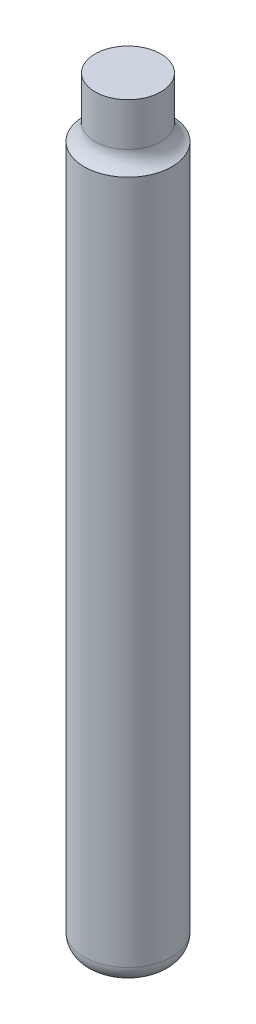
ISO-10303-21;
HEADER;
FILE_DESCRIPTION(('STEP AP214'),'2;1');
FILE_NAME('part.step','',(''),(''),'','','');
FILE_SCHEMA(('AUTOMOTIVE_DESIGN { 1 0 10303 214 1 1 1 1 }'));
ENDSEC;
DATA;
#1=APPLICATION_CONTEXT('core data for automotive mechanical design processes');
#2=APPLICATION_PROTOCOL_DEFINITION('international standard','automotive_design',2000,#1);
#3=PRODUCT_CONTEXT('',#1,'mechanical');
#4=PRODUCT('Part','Part','',(#3));
#5=PRODUCT_RELATED_PRODUCT_CATEGORY('part','',(#4));
#6=PRODUCT_DEFINITION_FORMATION('','',#4);
#7=PRODUCT_DEFINITION_CONTEXT('part definition',#1,'design');
#8=PRODUCT_DEFINITION('design','',#6,#7);
#9=PRODUCT_DEFINITION_SHAPE('','',#8);
#10=(LENGTH_UNIT() NAMED_UNIT(*) SI_UNIT(.MILLI.,.METRE.));
#11=(NAMED_UNIT(*) PLANE_ANGLE_UNIT() SI_UNIT($,.RADIAN.));
#12=(NAMED_UNIT(*) SI_UNIT($,.STERADIAN.) SOLID_ANGLE_UNIT());
#13=UNCERTAINTY_MEASURE_WITH_UNIT(LENGTH_MEASURE(1.E-05),#10,'distance_accuracy_value','');
#14=(GEOMETRIC_REPRESENTATION_CONTEXT(3) GLOBAL_UNCERTAINTY_ASSIGNED_CONTEXT((#13)) GLOBAL_UNIT_ASSIGNED_CONTEXT((#10,
#11,#12)) REPRESENTATION_CONTEXT('',''));
#15=CARTESIAN_POINT('',(0.,0.,0.));
#16=DIRECTION('',(0.,0.,1.));
#17=DIRECTION('',(1.,0.,0.));
#18=AXIS2_PLACEMENT_3D('',#15,#16,#17);
#19=CARTESIAN_POINT('',(0.,50.8,0.));
#20=DIRECTION('',(0.,-1.,0.));
#21=DIRECTION('',(0.,0.,-1.));
#22=AXIS2_PLACEMENT_3D('',#19,#20,#21);
#23=CYLINDRICAL_SURFACE('',#22,3.175);
#24=CARTESIAN_POINT('',(0.,1.27,0.));
#25=DIRECTION('',(0.,1.,0.));
#26=DIRECTION('',(0.,0.,1.));
#27=AXIS2_PLACEMENT_3D('',#24,#25,#26);
#28=CIRCLE('',#27,3.175);
#29=CARTESIAN_POINT('',(0.,1.27,3.175));
#30=VERTEX_POINT('',#29);
#31=EDGE_CURVE('E52',#30,#30,#28,.T.);
#32=ORIENTED_EDGE('',*,*,#31,.T.);
#33=EDGE_LOOP('',(#32));
#34=FACE_BOUND('',#33,.T.);
#35=CARTESIAN_POINT('',(0.,50.8,0.));
#36=DIRECTION('',(0.,1.,0.));
#37=DIRECTION('',(0.,0.,1.));
#38=AXIS2_PLACEMENT_3D('',#35,#36,#37);
#39=CIRCLE('',#38,3.175);
#40=CARTESIAN_POINT('',(0.,50.8,3.175));
#41=VERTEX_POINT('',#40);
#42=EDGE_CURVE('E49',#41,#41,#39,.T.);
#43=ORIENTED_EDGE('',*,*,#42,.F.);
#44=EDGE_LOOP('',(#43));
#45=FACE_BOUND('',#44,.T.);
#46=ADVANCED_FACE('F35',(#34,#45),#23,.T.);
#47=CARTESIAN_POINT('',(0.,0.,0.));
#48=DIRECTION('',(0.,1.,0.));
#49=DIRECTION('',(0.,0.,1.));
#50=AXIS2_PLACEMENT_3D('',#47,#48,#49);
#51=PLANE('',#50);
#52=CARTESIAN_POINT('',(0.,0.,0.));
#53=DIRECTION('',(0.,1.,0.));
#54=DIRECTION('',(0.,0.,1.));
#55=AXIS2_PLACEMENT_3D('',#52,#53,#54);
#56=CIRCLE('',#55,1.905);
#57=CARTESIAN_POINT('',(0.,0.,1.905));
#58=VERTEX_POINT('',#57);
#59=EDGE_CURVE('E42',#58,#58,#56,.F.);
#60=ORIENTED_EDGE('',*,*,#59,.T.);
#61=EDGE_LOOP('',(#60));
#62=FACE_BOUND('',#61,.T.);
#63=ADVANCED_FACE('F59',(#62),#51,.F.);
#64=CARTESIAN_POINT('',(0.,1.27,0.));
#65=DIRECTION('',(0.,1.,0.));
#66=DIRECTION('',(0.,0.,1.));
#67=AXIS2_PLACEMENT_3D('',#64,#65,#66);
#68=TOROIDAL_SURFACE('',#67,1.905,1.27);
#69=ORIENTED_EDGE('',*,*,#59,.F.);
#70=EDGE_LOOP('',(#69));
#71=FACE_BOUND('',#70,.T.);
#72=ORIENTED_EDGE('',*,*,#31,.F.);
#73=EDGE_LOOP('',(#72));
#74=FACE_BOUND('',#73,.T.);
#75=ADVANCED_FACE('F61',(#71,#74),#68,.T.);
#76=CARTESIAN_POINT('',(0.,55.0959623068477,0.));
#77=DIRECTION('',(0.,1.,0.));
#78=DIRECTION('',(0.,0.,1.));
#79=AXIS2_PLACEMENT_3D('',#76,#77,#78);
#80=PLANE('',#79);
#81=CARTESIAN_POINT('',(0.,55.0959623068477,0.));
#82=DIRECTION('',(0.,1.,0.));
#83=DIRECTION('',(0.,0.,1.));
#84=AXIS2_PLACEMENT_3D('',#81,#82,#83);
#85=CIRCLE('',#84,2.38125);
#86=CARTESIAN_POINT('',(0.,55.0959623068477,2.38125));
#87=VERTEX_POINT('',#86);
#88=EDGE_CURVE('E46',#87,#87,#85,.T.);
#89=ORIENTED_EDGE('',*,*,#88,.T.);
#90=EDGE_LOOP('',(#89));
#91=FACE_BOUND('',#90,.T.);
#92=ADVANCED_FACE('F47',(#91),#80,.T.);
#93=CARTESIAN_POINT('',(0.,50.8,0.));
#94=DIRECTION('',(0.,1.,0.));
#95=DIRECTION('',(0.,0.,1.));
#96=AXIS2_PLACEMENT_3D('',#93,#94,#95);
#97=CYLINDRICAL_SURFACE('',#96,2.38125);
#98=CARTESIAN_POINT('',(0.,51.9773215098264,0.));
#99=DIRECTION('',(0.,-1.,0.));
#100=DIRECTION('',(0.,0.,-1.));
#101=AXIS2_PLACEMENT_3D('',#98,#99,#100);
#102=CIRCLE('',#101,2.38125);
#103=CARTESIAN_POINT('',(0.,51.9773215098264,-2.38125));
#104=VERTEX_POINT('',#103);
#105=EDGE_CURVE('E11',#104,#104,#102,.F.);
#106=ORIENTED_EDGE('',*,*,#105,.T.);
#107=EDGE_LOOP('',(#106));
#108=FACE_BOUND('',#107,.T.);
#109=ORIENTED_EDGE('',*,*,#88,.F.);
#110=EDGE_LOOP('',(#109));
#111=FACE_BOUND('',#110,.T.);
#112=ADVANCED_FACE('F64',(#108,#111),#97,.T.);
#113=CARTESIAN_POINT('',(0.,51.9773215098264,0.));
#114=DIRECTION('',(0.,-1.,0.));
#115=DIRECTION('',(0.,0.,-1.));
#116=AXIS2_PLACEMENT_3D('',#113,#114,#115);
#117=TOROIDAL_SURFACE('',#116,3.65125,1.27);
#118=ORIENTED_EDGE('',*,*,#42,.T.);
#119=EDGE_LOOP('',(#118));
#120=FACE_BOUND('',#119,.T.);
#121=ORIENTED_EDGE('',*,*,#105,.F.);
#122=EDGE_LOOP('',(#121));
#123=FACE_BOUND('',#122,.T.);
#124=ADVANCED_FACE('F37',(#120,#123),#117,.F.);
#125=CLOSED_SHELL('',(#46,#63,#75,#92,#112,#124));
#126=MANIFOLD_SOLID_BREP('B2',#125);
#127=ADVANCED_BREP_SHAPE_REPRESENTATION('',(#18,#126),#14);
#128=SHAPE_DEFINITION_REPRESENTATION(#9,#127);
ENDSEC;
END-ISO-10303-21;
